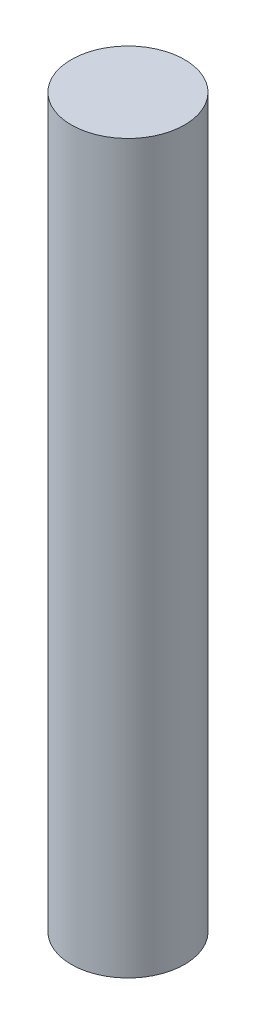
ISO-10303-21;
HEADER;
FILE_DESCRIPTION(('STEP AP214'),'2;1');
FILE_NAME('part.step','',(''),(''),'','','');
FILE_SCHEMA(('AUTOMOTIVE_DESIGN { 1 0 10303 214 1 1 1 1 }'));
ENDSEC;
DATA;
#1=APPLICATION_CONTEXT('core data for automotive mechanical design processes');
#2=APPLICATION_PROTOCOL_DEFINITION('international standard','automotive_design',2000,#1);
#3=PRODUCT_CONTEXT('',#1,'mechanical');
#4=PRODUCT('Part','Part','',(#3));
#5=PRODUCT_RELATED_PRODUCT_CATEGORY('part','',(#4));
#6=PRODUCT_DEFINITION_FORMATION('','',#4);
#7=PRODUCT_DEFINITION_CONTEXT('part definition',#1,'design');
#8=PRODUCT_DEFINITION('design','',#6,#7);
#9=PRODUCT_DEFINITION_SHAPE('','',#8);
#10=(LENGTH_UNIT() NAMED_UNIT(*) SI_UNIT(.MILLI.,.METRE.));
#11=(NAMED_UNIT(*) PLANE_ANGLE_UNIT() SI_UNIT($,.RADIAN.));
#12=(NAMED_UNIT(*) SI_UNIT($,.STERADIAN.) SOLID_ANGLE_UNIT());
#13=UNCERTAINTY_MEASURE_WITH_UNIT(LENGTH_MEASURE(1.E-05),#10,'distance_accuracy_value','');
#14=(GEOMETRIC_REPRESENTATION_CONTEXT(3) GLOBAL_UNCERTAINTY_ASSIGNED_CONTEXT((#13)) GLOBAL_UNIT_ASSIGNED_CONTEXT((#10,
#11,#12)) REPRESENTATION_CONTEXT('',''));
#15=CARTESIAN_POINT('',(0.,0.,0.));
#16=DIRECTION('',(0.,0.,1.));
#17=DIRECTION('',(1.,0.,0.));
#18=AXIS2_PLACEMENT_3D('',#15,#16,#17);
#19=CARTESIAN_POINT('',(0.,25.675,0.));
#20=DIRECTION('',(0.,-1.,0.));
#21=DIRECTION('',(0.,0.,-1.));
#22=AXIS2_PLACEMENT_3D('',#19,#20,#21);
#23=CYLINDRICAL_SURFACE('',#22,4.);
#24=CARTESIAN_POINT('',(0.,25.675,0.));
#25=DIRECTION('',(0.,1.,0.));
#26=DIRECTION('',(0.,0.,1.));
#27=AXIS2_PLACEMENT_3D('',#24,#25,#26);
#28=CIRCLE('',#27,4.);
#29=CARTESIAN_POINT('',(0.,25.675,4.));
#30=VERTEX_POINT('',#29);
#31=EDGE_CURVE('E10',#30,#30,#28,.T.);
#32=ORIENTED_EDGE('',*,*,#31,.F.);
#33=EDGE_LOOP('',(#32));
#34=FACE_BOUND('',#33,.T.);
#35=CARTESIAN_POINT('',(0.,-25.675,0.));
#36=DIRECTION('',(0.,1.,0.));
#37=DIRECTION('',(0.,0.,1.));
#38=AXIS2_PLACEMENT_3D('',#35,#36,#37);
#39=CIRCLE('',#38,4.);
#40=CARTESIAN_POINT('',(0.,-25.675,4.));
#41=VERTEX_POINT('',#40);
#42=EDGE_CURVE('E46',#41,#41,#39,.T.);
#43=ORIENTED_EDGE('',*,*,#42,.T.);
#44=EDGE_LOOP('',(#43));
#45=FACE_BOUND('',#44,.T.);
#46=ADVANCED_FACE('F43',(#34,#45),#23,.T.);
#47=CARTESIAN_POINT('',(0.,25.675,0.));
#48=DIRECTION('',(0.,1.,0.));
#49=DIRECTION('',(0.,0.,1.));
#50=AXIS2_PLACEMENT_3D('',#47,#48,#49);
#51=PLANE('',#50);
#52=ORIENTED_EDGE('',*,*,#31,.T.);
#53=EDGE_LOOP('',(#52));
#54=FACE_BOUND('',#53,.T.);
#55=ADVANCED_FACE('F60',(#54),#51,.T.);
#56=CARTESIAN_POINT('',(0.,-25.675,0.));
#57=DIRECTION('',(0.,1.,0.));
#58=DIRECTION('',(0.,0.,1.));
#59=AXIS2_PLACEMENT_3D('',#56,#57,#58);
#60=PLANE('',#59);
#61=ORIENTED_EDGE('',*,*,#42,.F.);
#62=EDGE_LOOP('',(#61));
#63=FACE_BOUND('',#62,.T.);
#64=ADVANCED_FACE('F58',(#63),#60,.F.);
#65=CLOSED_SHELL('',(#46,#55,#64));
#66=MANIFOLD_SOLID_BREP('B2',#65);
#67=ADVANCED_BREP_SHAPE_REPRESENTATION('',(#18,#66),#14);
#68=SHAPE_DEFINITION_REPRESENTATION(#9,#67);
ENDSEC;
END-ISO-10303-21;
